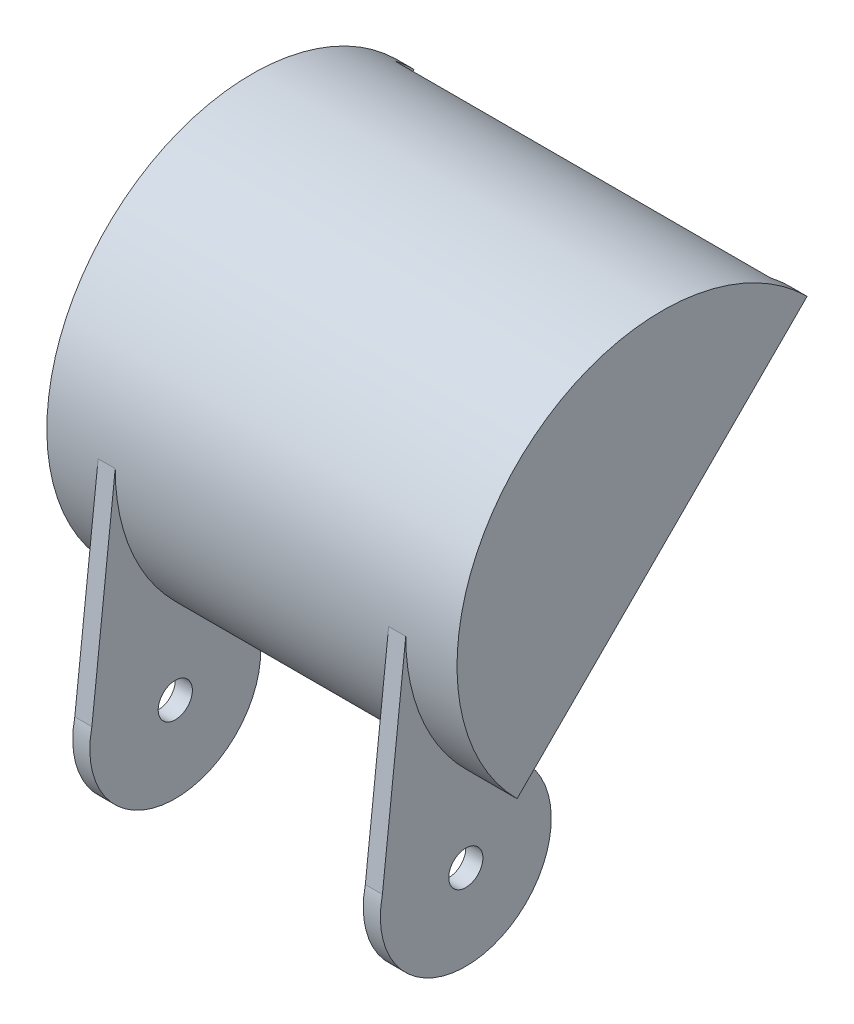
ISO-10303-21;
HEADER;
FILE_DESCRIPTION(('STEP AP214'),'2;1');
FILE_NAME('part.step','',(''),(''),'','','');
FILE_SCHEMA(('AUTOMOTIVE_DESIGN { 1 0 10303 214 1 1 1 1 }'));
ENDSEC;
DATA;
#1=APPLICATION_CONTEXT('core data for automotive mechanical design processes');
#2=APPLICATION_PROTOCOL_DEFINITION('international standard','automotive_design',2000,#1);
#3=PRODUCT_CONTEXT('',#1,'mechanical');
#4=PRODUCT('Part','Part','',(#3));
#5=PRODUCT_RELATED_PRODUCT_CATEGORY('part','',(#4));
#6=PRODUCT_DEFINITION_FORMATION('','',#4);
#7=PRODUCT_DEFINITION_CONTEXT('part definition',#1,'design');
#8=PRODUCT_DEFINITION('design','',#6,#7);
#9=PRODUCT_DEFINITION_SHAPE('','',#8);
#10=(LENGTH_UNIT() NAMED_UNIT(*) SI_UNIT(.MILLI.,.METRE.));
#11=(NAMED_UNIT(*) PLANE_ANGLE_UNIT() SI_UNIT($,.RADIAN.));
#12=(NAMED_UNIT(*) SI_UNIT($,.STERADIAN.) SOLID_ANGLE_UNIT());
#13=UNCERTAINTY_MEASURE_WITH_UNIT(LENGTH_MEASURE(1.E-05),#10,'distance_accuracy_value','');
#14=(GEOMETRIC_REPRESENTATION_CONTEXT(3) GLOBAL_UNCERTAINTY_ASSIGNED_CONTEXT((#13)) GLOBAL_UNIT_ASSIGNED_CONTEXT((#10,
#11,#12)) REPRESENTATION_CONTEXT('',''));
#15=CARTESIAN_POINT('',(0.,0.,0.));
#16=DIRECTION('',(0.,0.,1.));
#17=DIRECTION('',(1.,0.,0.));
#18=AXIS2_PLACEMENT_3D('',#15,#16,#17);
#19=CARTESIAN_POINT('',(28.575,2.24506403026729,-2.24506403026728));
#20=DIRECTION('',(0.,0.,1.));
#21=DIRECTION('',(1.,0.,0.));
#22=AXIS2_PLACEMENT_3D('',#19,#20,#21);
#23=PLANE('',#22);
#24=DIRECTION('',(0.,1.,0.));
#25=VECTOR('',#24,1.);
#26=CARTESIAN_POINT('',(-25.4,-0.15955178812898,-2.24506403026728));
#27=LINE('',#26,#25);
#28=CARTESIAN_POINT('',(-25.4,-0.15955178812898,-2.24506403026728));
#29=VERTEX_POINT('',#28);
#30=CARTESIAN_POINT('',(-25.4,2.24506403026729,-2.24506403026728));
#31=VERTEX_POINT('',#30);
#32=EDGE_CURVE('E205',#29,#31,#27,.T.);
#33=ORIENTED_EDGE('',*,*,#32,.F.);
#34=DIRECTION('',(-1.,0.,0.));
#35=VECTOR('',#34,1.);
#36=CARTESIAN_POINT('',(28.575,-0.15955178812898,-2.24506403026728));
#37=LINE('',#36,#35);
#38=CARTESIAN_POINT('',(-28.575,-0.15955178812898,-2.24506403026728));
#39=VERTEX_POINT('',#38);
#40=EDGE_CURVE('E215',#29,#39,#37,.T.);
#41=ORIENTED_EDGE('',*,*,#40,.T.);
#42=DIRECTION('',(0.,1.,0.));
#43=VECTOR('',#42,1.);
#44=CARTESIAN_POINT('',(-28.575,2.24506403026729,-2.24506403026728));
#45=LINE('',#44,#43);
#46=CARTESIAN_POINT('',(-28.575,2.24506403026729,-2.24506403026728));
#47=VERTEX_POINT('',#46);
#48=EDGE_CURVE('E422',#39,#47,#45,.T.);
#49=ORIENTED_EDGE('',*,*,#48,.T.);
#50=DIRECTION('',(-1.,0.,0.));
#51=VECTOR('',#50,1.);
#52=CARTESIAN_POINT('',(28.575,2.24506403026729,-2.24506403026728));
#53=LINE('',#52,#51);
#54=EDGE_CURVE('E70',#31,#47,#53,.T.);
#55=ORIENTED_EDGE('',*,*,#54,.F.);
#56=EDGE_LOOP('',(#33,#41,#49,#55));
#57=FACE_BOUND('',#56,.T.);
#58=ADVANCED_FACE('F47',(#57),#23,.F.);
#59=CARTESIAN_POINT('',(-75.0672223709817,26.9407683632072,11.1592316367926));
#60=DIRECTION('',(0.,0.109478882044128,0.993989121865208));
#61=DIRECTION('',(0.,-0.993989121865208,0.109478882044128));
#62=AXIS2_PLACEMENT_3D('',#59,#60,#61);
#63=PLANE('',#62);
#64=DIRECTION('',(-1.,0.,0.));
#65=VECTOR('',#64,1.);
#66=CARTESIAN_POINT('',(28.575,-12.4199390340299,15.4944563867672));
#67=LINE('',#66,#65);
#68=CARTESIAN_POINT('',(-25.4,-12.4199390340299,15.4944563867672));
#69=VERTEX_POINT('',#68);
#70=CARTESIAN_POINT('',(-28.575,-12.4199390340299,15.4944563867672));
#71=VERTEX_POINT('',#70);
#72=EDGE_CURVE('E369',#69,#71,#67,.T.);
#73=ORIENTED_EDGE('',*,*,#72,.F.);
#74=DIRECTION('',(0.,-0.993989121865208,0.109478882044128));
#75=VECTOR('',#74,1.);
#76=CARTESIAN_POINT('',(-25.4,26.9407683632072,11.1592316367926));
#77=LINE('',#76,#75);
#78=CARTESIAN_POINT('',(-25.4,26.9407683632072,11.1592316367926));
#79=VERTEX_POINT('',#78);
#80=EDGE_CURVE('E207',#79,#69,#77,.T.);
#81=ORIENTED_EDGE('',*,*,#80,.F.);
#82=DIRECTION('',(1.,0.,0.));
#83=VECTOR('',#82,1.);
#84=CARTESIAN_POINT('',(-75.0672223709817,26.9407683632072,11.1592316367926));
#85=LINE('',#84,#83);
#86=CARTESIAN_POINT('',(-28.575,26.9407683632072,11.1592316367926));
#87=VERTEX_POINT('',#86);
#88=EDGE_CURVE('E334',#87,#79,#85,.T.);
#89=ORIENTED_EDGE('',*,*,#88,.F.);
#90=DIRECTION('',(0.,0.993989121865208,-0.109478882044128));
#91=VECTOR('',#90,1.);
#92=CARTESIAN_POINT('',(-28.575,26.9407683632072,11.1592316367926));
#93=LINE('',#92,#91);
#94=EDGE_CURVE('E339',#71,#87,#93,.T.);
#95=ORIENTED_EDGE('',*,*,#94,.F.);
#96=EDGE_LOOP('',(#73,#81,#89,#95));
#97=FACE_BOUND('',#96,.T.);
#98=ADVANCED_FACE('F768',(#97),#63,.T.);
#99=CARTESIAN_POINT('',(28.575,-15.875,0.));
#100=DIRECTION('',(-1.,0.,0.));
#101=DIRECTION('',(0.,0.,1.));
#102=AXIS2_PLACEMENT_3D('',#99,#100,#101);
#103=CYLINDRICAL_SURFACE('',#102,15.875);
#104=CARTESIAN_POINT('',(-25.4,-15.875,0.));
#105=DIRECTION('',(1.,0.,0.));
#106=DIRECTION('',(0.,0.,-1.));
#107=AXIS2_PLACEMENT_3D('',#104,#105,#106);
#108=CIRCLE('',#107,15.875);
#109=EDGE_CURVE('E12',#69,#29,#108,.T.);
#110=ORIENTED_EDGE('',*,*,#109,.F.);
#111=ORIENTED_EDGE('',*,*,#72,.T.);
#112=CARTESIAN_POINT('',(-28.575,-15.875,0.));
#113=DIRECTION('',(1.,0.,0.));
#114=DIRECTION('',(0.,0.,-1.));
#115=AXIS2_PLACEMENT_3D('',#112,#113,#114);
#116=CIRCLE('',#115,15.875);
#117=EDGE_CURVE('E223',#71,#39,#116,.T.);
#118=ORIENTED_EDGE('',*,*,#117,.T.);
#119=ORIENTED_EDGE('',*,*,#40,.F.);
#120=EDGE_LOOP('',(#110,#111,#118,#119));
#121=FACE_BOUND('',#120,.T.);
#122=ADVANCED_FACE('F221',(#121),#103,.T.);
#123=CARTESIAN_POINT('',(38.1,0.,0.));
#124=DIRECTION('',(0.,0.707106781186546,0.707106781186549));
#125=DIRECTION('',(0.,-0.707106781186549,0.707106781186546));
#126=AXIS2_PLACEMENT_3D('',#123,#124,#125);
#127=PLANE('',#126);
#128=DIRECTION('',(0.,-0.707106781186549,0.707106781186546));
#129=VECTOR('',#128,1.);
#130=CARTESIAN_POINT('',(-28.575,2.24506403026729,-2.24506403026728));
#131=LINE('',#130,#129);
#132=CARTESIAN_POINT('',(-28.575,0.,0.));
#133=VERTEX_POINT('',#132);
#134=EDGE_CURVE('E499',#47,#133,#131,.T.);
#135=ORIENTED_EDGE('',*,*,#134,.T.);
#136=DIRECTION('',(-1.,0.,0.));
#137=VECTOR('',#136,1.);
#138=CARTESIAN_POINT('',(38.1,0.,0.));
#139=LINE('',#138,#137);
#140=CARTESIAN_POINT('',(-38.1,0.,0.));
#141=VERTEX_POINT('',#140);
#142=EDGE_CURVE('E387',#133,#141,#139,.T.);
#143=ORIENTED_EDGE('',*,*,#142,.T.);
#144=DIRECTION('',(0.,0.707106781186549,-0.707106781186546));
#145=VECTOR('',#144,1.);
#146=CARTESIAN_POINT('',(-38.1,0.,0.));
#147=LINE('',#146,#145);
#148=CARTESIAN_POINT('',(-38.1,53.881536726415,-53.8815367264148));
#149=VERTEX_POINT('',#148);
#150=EDGE_CURVE('E457',#141,#149,#147,.T.);
#151=ORIENTED_EDGE('',*,*,#150,.T.);
#152=DIRECTION('',(-1.,0.,0.));
#153=VECTOR('',#152,1.);
#154=CARTESIAN_POINT('',(38.1,53.881536726415,-53.8815367264148));
#155=LINE('',#154,#153);
#156=CARTESIAN_POINT('',(-34.925,53.881536726415,-53.8815367264148));
#157=VERTEX_POINT('',#156);
#158=EDGE_CURVE('E573',#157,#149,#155,.T.);
#159=ORIENTED_EDGE('',*,*,#158,.F.);
#160=DIRECTION('',(0.,0.707106781186549,-0.707106781186546));
#161=VECTOR('',#160,1.);
#162=CARTESIAN_POINT('',(-34.925,0.,0.));
#163=LINE('',#162,#161);
#164=CARTESIAN_POINT('',(-34.925,2.24506403026729,-2.24506403026728));
#165=VERTEX_POINT('',#164);
#166=EDGE_CURVE('E441',#165,#157,#163,.T.);
#167=ORIENTED_EDGE('',*,*,#166,.F.);
#168=DIRECTION('',(-1.,0.,0.));
#169=VECTOR('',#168,1.);
#170=CARTESIAN_POINT('',(34.925,2.24506403026729,-2.24506403026728));
#171=LINE('',#170,#169);
#172=EDGE_CURVE('E438',#47,#165,#171,.T.);
#173=ORIENTED_EDGE('',*,*,#172,.F.);
#174=EDGE_LOOP('',(#135,#143,#151,#159,#167,#173));
#175=FACE_BOUND('',#174,.T.);
#176=ADVANCED_FACE('F598',(#175),#127,.F.);
#177=CARTESIAN_POINT('',(38.1,0.,0.));
#178=VERTEX_POINT('',#177);
#179=CARTESIAN_POINT('',(28.575,0.,0.));
#180=VERTEX_POINT('',#179);
#181=EDGE_CURVE('E380',#178,#180,#139,.T.);
#182=ORIENTED_EDGE('',*,*,#181,.T.);
#183=DIRECTION('',(0.,-0.707106781186549,0.707106781186546));
#184=VECTOR('',#183,1.);
#185=CARTESIAN_POINT('',(28.575,2.24506403026729,-2.24506403026728));
#186=LINE('',#185,#184);
#187=CARTESIAN_POINT('',(28.575,2.24506403026729,-2.24506403026728));
#188=VERTEX_POINT('',#187);
#189=EDGE_CURVE('E416',#188,#180,#186,.T.);
#190=ORIENTED_EDGE('',*,*,#189,.F.);
#191=CARTESIAN_POINT('',(34.925,2.24506403026729,-2.24506403026728));
#192=VERTEX_POINT('',#191);
#193=EDGE_CURVE('E432',#192,#188,#171,.T.);
#194=ORIENTED_EDGE('',*,*,#193,.F.);
#195=DIRECTION('',(0.,0.707106781186549,-0.707106781186546));
#196=VECTOR('',#195,1.);
#197=CARTESIAN_POINT('',(34.925,0.,0.));
#198=LINE('',#197,#196);
#199=CARTESIAN_POINT('',(34.925,53.881536726415,-53.8815367264148));
#200=VERTEX_POINT('',#199);
#201=EDGE_CURVE('E82',#192,#200,#198,.T.);
#202=ORIENTED_EDGE('',*,*,#201,.T.);
#203=CARTESIAN_POINT('',(38.1,53.881536726415,-53.8815367264148));
#204=VERTEX_POINT('',#203);
#205=EDGE_CURVE('E388',#204,#200,#155,.T.);
#206=ORIENTED_EDGE('',*,*,#205,.F.);
#207=DIRECTION('',(0.,0.707106781186549,-0.707106781186546));
#208=VECTOR('',#207,1.);
#209=CARTESIAN_POINT('',(38.1,0.,0.));
#210=LINE('',#209,#208);
#211=EDGE_CURVE('E567',#178,#204,#210,.T.);
#212=ORIENTED_EDGE('',*,*,#211,.F.);
#213=EDGE_LOOP('',(#182,#190,#194,#202,#206,#212));
#214=FACE_BOUND('',#213,.T.);
#215=ADVANCED_FACE('F749',(#214),#127,.F.);
#216=CARTESIAN_POINT('',(38.1,26.9407683632075,-26.9407683632074));
#217=DIRECTION('',(-1.,0.,0.));
#218=DIRECTION('',(0.,0.,1.));
#219=AXIS2_PLACEMENT_3D('',#216,#217,#218);
#220=CYLINDRICAL_SURFACE('',#219,38.1);
#221=ORIENTED_EDGE('',*,*,#88,.T.);
#222=CARTESIAN_POINT('',(-25.4,26.9407683632075,-26.9407683632074));
#223=DIRECTION('',(-1.,0.,0.));
#224=DIRECTION('',(0.,0.,-1.));
#225=AXIS2_PLACEMENT_3D('',#222,#223,#224);
#226=CIRCLE('',#225,38.1);
#227=CARTESIAN_POINT('',(-25.4,0.,0.));
#228=VERTEX_POINT('',#227);
#229=EDGE_CURVE('E511',#228,#79,#226,.T.);
#230=ORIENTED_EDGE('',*,*,#229,.F.);
#231=DIRECTION('',(1.,0.,0.));
#232=VECTOR('',#231,1.);
#233=CARTESIAN_POINT('',(-25.4,0.,0.));
#234=LINE('',#233,#232);
#235=CARTESIAN_POINT('',(25.4,0.,0.));
#236=VERTEX_POINT('',#235);
#237=EDGE_CURVE('E310',#228,#236,#234,.T.);
#238=ORIENTED_EDGE('',*,*,#237,.T.);
#239=CARTESIAN_POINT('',(25.4,26.9407683632075,-26.9407683632074));
#240=DIRECTION('',(-1.,0.,0.));
#241=DIRECTION('',(0.,0.,-1.));
#242=AXIS2_PLACEMENT_3D('',#239,#240,#241);
#243=CIRCLE('',#242,38.1);
#244=CARTESIAN_POINT('',(25.4,26.9407683632072,11.1592316367926));
#245=VERTEX_POINT('',#244);
#246=EDGE_CURVE('E294',#236,#245,#243,.T.);
#247=ORIENTED_EDGE('',*,*,#246,.T.);
#248=CARTESIAN_POINT('',(28.575,26.9407683632072,11.1592316367926));
#249=VERTEX_POINT('',#248);
#250=EDGE_CURVE('E340',#245,#249,#85,.T.);
#251=ORIENTED_EDGE('',*,*,#250,.T.);
#252=CARTESIAN_POINT('',(28.575,26.9407683632075,-26.9407683632074));
#253=DIRECTION('',(1.,0.,0.));
#254=DIRECTION('',(0.,0.,-1.));
#255=AXIS2_PLACEMENT_3D('',#252,#253,#254);
#256=CIRCLE('',#255,38.1);
#257=EDGE_CURVE('E363',#249,#180,#256,.T.);
#258=ORIENTED_EDGE('',*,*,#257,.T.);
#259=ORIENTED_EDGE('',*,*,#181,.F.);
#260=CARTESIAN_POINT('',(38.1,26.9407683632075,-26.9407683632074));
#261=DIRECTION('',(1.,0.,0.));
#262=DIRECTION('',(0.,0.,-1.));
#263=AXIS2_PLACEMENT_3D('',#260,#261,#262);
#264=CIRCLE('',#263,38.1);
#265=EDGE_CURVE('E462',#204,#178,#264,.T.);
#266=ORIENTED_EDGE('',*,*,#265,.F.);
#267=ORIENTED_EDGE('',*,*,#205,.T.);
#268=CARTESIAN_POINT('',(34.925,26.9407683632075,-26.9407683632074));
#269=DIRECTION('',(1.,0.,0.));
#270=DIRECTION('',(0.,0.,-1.));
#271=AXIS2_PLACEMENT_3D('',#268,#269,#270);
#272=CIRCLE('',#271,38.1);
#273=CARTESIAN_POINT('',(34.925,57.0511320390414,-50.2854893790821));
#274=VERTEX_POINT('',#273);
#275=EDGE_CURVE('E386',#200,#274,#272,.T.);
#276=ORIENTED_EDGE('',*,*,#275,.T.);
#277=DIRECTION('',(-1.,0.,0.));
#278=VECTOR('',#277,1.);
#279=CARTESIAN_POINT('',(0.,57.0511320390414,-50.2854893790821));
#280=LINE('',#279,#278);
#281=CARTESIAN_POINT('',(-34.925,57.0511320390414,-50.2854893790821));
#282=VERTEX_POINT('',#281);
#283=EDGE_CURVE('E551',#274,#282,#280,.T.);
#284=ORIENTED_EDGE('',*,*,#283,.T.);
#285=CARTESIAN_POINT('',(-34.925,26.9407683632075,-26.9407683632074));
#286=DIRECTION('',(1.,0.,0.));
#287=DIRECTION('',(0.,0.,-1.));
#288=AXIS2_PLACEMENT_3D('',#285,#286,#287);
#289=CIRCLE('',#288,38.1);
#290=EDGE_CURVE('E548',#282,#157,#289,.F.);
#291=ORIENTED_EDGE('',*,*,#290,.T.);
#292=ORIENTED_EDGE('',*,*,#158,.T.);
#293=CARTESIAN_POINT('',(-38.1,26.9407683632075,-26.9407683632074));
#294=DIRECTION('',(1.,0.,0.));
#295=DIRECTION('',(0.,0.,-1.));
#296=AXIS2_PLACEMENT_3D('',#293,#294,#295);
#297=CIRCLE('',#296,38.1);
#298=EDGE_CURVE('E437',#149,#141,#297,.T.);
#299=ORIENTED_EDGE('',*,*,#298,.T.);
#300=ORIENTED_EDGE('',*,*,#142,.F.);
#301=CARTESIAN_POINT('',(-28.575,26.9407683632075,-26.9407683632074));
#302=DIRECTION('',(1.,0.,0.));
#303=DIRECTION('',(0.,0.,-1.));
#304=AXIS2_PLACEMENT_3D('',#301,#302,#303);
#305=CIRCLE('',#304,38.1);
#306=EDGE_CURVE('E368',#87,#133,#305,.T.);
#307=ORIENTED_EDGE('',*,*,#306,.F.);
#308=EDGE_LOOP('',(#221,#230,#238,#247,#251,#258,#259,#266,#267,#276,#284,#291,#292,#299,#300,#307));
#309=FACE_BOUND('',#308,.T.);
#310=ADVANCED_FACE('F604',(#309),#220,.T.);
#311=CARTESIAN_POINT('',(38.1,26.9407683632075,-26.9407683632074));
#312=DIRECTION('',(1.,0.,0.));
#313=DIRECTION('',(0.,0.,-1.));
#314=AXIS2_PLACEMENT_3D('',#311,#312,#313);
#315=PLANE('',#314);
#316=ORIENTED_EDGE('',*,*,#265,.T.);
#317=ORIENTED_EDGE('',*,*,#211,.T.);
#318=EDGE_LOOP('',(#316,#317));
#319=FACE_BOUND('',#318,.T.);
#320=ADVANCED_FACE('F820',(#319),#315,.T.);
#321=CARTESIAN_POINT('',(-38.1,26.9407683632075,-26.9407683632074));
#322=DIRECTION('',(1.,0.,0.));
#323=DIRECTION('',(0.,0.,-1.));
#324=AXIS2_PLACEMENT_3D('',#321,#322,#323);
#325=PLANE('',#324);
#326=ORIENTED_EDGE('',*,*,#298,.F.);
#327=ORIENTED_EDGE('',*,*,#150,.F.);
#328=EDGE_LOOP('',(#326,#327));
#329=FACE_BOUND('',#328,.T.);
#330=ADVANCED_FACE('F603',(#329),#325,.F.);
#331=CARTESIAN_POINT('',(38.1,26.9407683632075,-26.9407683632074));
#332=DIRECTION('',(-1.,0.,0.));
#333=DIRECTION('',(0.,0.,1.));
#334=AXIS2_PLACEMENT_3D('',#331,#332,#333);
#335=CYLINDRICAL_SURFACE('',#334,34.925);
#336=ORIENTED_EDGE('',*,*,#193,.T.);
#337=CARTESIAN_POINT('',(25.4,2.24506403026729,-2.24506403026728));
#338=VERTEX_POINT('',#337);
#339=EDGE_CURVE('E226',#188,#338,#53,.T.);
#340=ORIENTED_EDGE('',*,*,#339,.T.);
#341=DIRECTION('',(1.,0.,0.));
#342=VECTOR('',#341,1.);
#343=CARTESIAN_POINT('',(-25.4,2.24506403026729,-2.24506403026728));
#344=LINE('',#343,#342);
#345=EDGE_CURVE('E315',#31,#338,#344,.T.);
#346=ORIENTED_EDGE('',*,*,#345,.F.);
#347=ORIENTED_EDGE('',*,*,#54,.T.);
#348=ORIENTED_EDGE('',*,*,#172,.T.);
#349=CARTESIAN_POINT('',(-34.925,26.9407683632075,-26.9407683632074));
#350=DIRECTION('',(1.,0.,0.));
#351=DIRECTION('',(0.,0.,-1.));
#352=AXIS2_PLACEMENT_3D('',#349,#350,#351);
#353=CIRCLE('',#352,34.925);
#354=CARTESIAN_POINT('',(-34.925,56.513988483178,-45.5197962370164));
#355=VERTEX_POINT('',#354);
#356=EDGE_CURVE('E232',#355,#165,#353,.T.);
#357=ORIENTED_EDGE('',*,*,#356,.F.);
#358=DIRECTION('',(-1.,0.,0.));
#359=VECTOR('',#358,1.);
#360=CARTESIAN_POINT('',(38.1,56.513988483178,-45.5197962370164));
#361=LINE('',#360,#359);
#362=CARTESIAN_POINT('',(34.925,56.513988483178,-45.5197962370164));
#363=VERTEX_POINT('',#362);
#364=EDGE_CURVE('E544',#355,#363,#361,.F.);
#365=ORIENTED_EDGE('',*,*,#364,.T.);
#366=CARTESIAN_POINT('',(34.925,26.9407683632075,-26.9407683632074));
#367=DIRECTION('',(1.,0.,0.));
#368=DIRECTION('',(0.,0.,-1.));
#369=AXIS2_PLACEMENT_3D('',#366,#367,#368);
#370=CIRCLE('',#369,34.925);
#371=EDGE_CURVE('E439',#363,#192,#370,.T.);
#372=ORIENTED_EDGE('',*,*,#371,.T.);
#373=EDGE_LOOP('',(#336,#340,#346,#347,#348,#357,#365,#372));
#374=FACE_BOUND('',#373,.T.);
#375=ADVANCED_FACE('F745',(#374),#335,.F.);
#376=CARTESIAN_POINT('',(34.925,26.9407683632075,-26.9407683632074));
#377=DIRECTION('',(1.,0.,0.));
#378=DIRECTION('',(0.,0.,-1.));
#379=AXIS2_PLACEMENT_3D('',#376,#377,#378);
#380=PLANE('',#379);
#381=ORIENTED_EDGE('',*,*,#371,.F.);
#382=DIRECTION('',(0.,-0.11200131110685,0.993708058893731));
#383=VECTOR('',#382,1.);
#384=CARTESIAN_POINT('',(34.925,54.0752305896627,-23.8824301336417));
#385=LINE('',#384,#383);
#386=EDGE_CURVE('E59',#363,#274,#385,.F.);
#387=ORIENTED_EDGE('',*,*,#386,.T.);
#388=ORIENTED_EDGE('',*,*,#275,.F.);
#389=ORIENTED_EDGE('',*,*,#201,.F.);
#390=EDGE_LOOP('',(#381,#387,#388,#389));
#391=FACE_BOUND('',#390,.T.);
#392=ADVANCED_FACE('F747',(#391),#380,.F.);
#393=CARTESIAN_POINT('',(-34.925,26.9407683632075,-26.9407683632074));
#394=DIRECTION('',(1.,0.,0.));
#395=DIRECTION('',(0.,0.,-1.));
#396=AXIS2_PLACEMENT_3D('',#393,#394,#395);
#397=PLANE('',#396);
#398=ORIENTED_EDGE('',*,*,#166,.T.);
#399=ORIENTED_EDGE('',*,*,#290,.F.);
#400=DIRECTION('',(0.,0.11200131110685,-0.993708058893731));
#401=VECTOR('',#400,1.);
#402=CARTESIAN_POINT('',(-34.925,57.9105570692999,-57.9105570692997));
#403=LINE('',#402,#401);
#404=EDGE_CURVE('E541',#282,#355,#403,.F.);
#405=ORIENTED_EDGE('',*,*,#404,.T.);
#406=ORIENTED_EDGE('',*,*,#356,.T.);
#407=EDGE_LOOP('',(#398,#399,#405,#406));
#408=FACE_BOUND('',#407,.T.);
#409=ADVANCED_FACE('F743',(#408),#397,.T.);
#410=CARTESIAN_POINT('',(38.1,57.9105570692999,-57.9105570692997));
#411=DIRECTION('',(0.,0.993708058893731,0.11200131110685));
#412=DIRECTION('',(-1.,0.,0.));
#413=AXIS2_PLACEMENT_3D('',#410,#411,#412);
#414=PLANE('',#413);
#415=ORIENTED_EDGE('',*,*,#386,.F.);
#416=ORIENTED_EDGE('',*,*,#364,.F.);
#417=ORIENTED_EDGE('',*,*,#404,.F.);
#418=ORIENTED_EDGE('',*,*,#283,.F.);
#419=EDGE_LOOP('',(#415,#416,#417,#418));
#420=FACE_BOUND('',#419,.T.);
#421=ADVANCED_FACE('F50',(#420),#414,.F.);
#422=CARTESIAN_POINT('',(28.575,-0.159551788128983,-2.24506403026728));
#423=VERTEX_POINT('',#422);
#424=CARTESIAN_POINT('',(25.4,-0.15955178812898,-2.24506403026728));
#425=VERTEX_POINT('',#424);
#426=EDGE_CURVE('E225',#423,#425,#37,.T.);
#427=ORIENTED_EDGE('',*,*,#426,.T.);
#428=DIRECTION('',(0.,1.,0.));
#429=VECTOR('',#428,1.);
#430=CARTESIAN_POINT('',(25.4,-0.15955178812898,-2.24506403026728));
#431=LINE('',#430,#429);
#432=EDGE_CURVE('E295',#425,#338,#431,.T.);
#433=ORIENTED_EDGE('',*,*,#432,.T.);
#434=ORIENTED_EDGE('',*,*,#339,.F.);
#435=DIRECTION('',(0.,1.,0.));
#436=VECTOR('',#435,1.);
#437=CARTESIAN_POINT('',(28.575,2.24506403026729,-2.24506403026728));
#438=LINE('',#437,#436);
#439=EDGE_CURVE('E421',#423,#188,#438,.T.);
#440=ORIENTED_EDGE('',*,*,#439,.F.);
#441=EDGE_LOOP('',(#427,#433,#434,#440));
#442=FACE_BOUND('',#441,.T.);
#443=ADVANCED_FACE('F753',(#442),#23,.F.);
#444=CARTESIAN_POINT('',(28.575,0.,0.));
#445=DIRECTION('',(1.,0.,0.));
#446=DIRECTION('',(0.,0.,-1.));
#447=AXIS2_PLACEMENT_3D('',#444,#445,#446);
#448=PLANE('',#447);
#449=CARTESIAN_POINT('',(28.575,-15.875,0.));
#450=DIRECTION('',(1.,0.,0.));
#451=DIRECTION('',(0.,0.,-1.));
#452=AXIS2_PLACEMENT_3D('',#449,#450,#451);
#453=CIRCLE('',#452,15.875);
#454=CARTESIAN_POINT('',(28.575,-12.4199390340299,15.4944563867672));
#455=VERTEX_POINT('',#454);
#456=EDGE_CURVE('E277',#455,#423,#453,.T.);
#457=ORIENTED_EDGE('',*,*,#456,.T.);
#458=ORIENTED_EDGE('',*,*,#439,.T.);
#459=ORIENTED_EDGE('',*,*,#189,.T.);
#460=ORIENTED_EDGE('',*,*,#257,.F.);
#461=DIRECTION('',(0.,-0.993989121865208,0.109478882044128));
#462=VECTOR('',#461,1.);
#463=CARTESIAN_POINT('',(28.575,26.9407683632072,11.1592316367926));
#464=LINE('',#463,#462);
#465=EDGE_CURVE('E314',#249,#455,#464,.T.);
#466=ORIENTED_EDGE('',*,*,#465,.T.);
#467=EDGE_LOOP('',(#457,#458,#459,#460,#466));
#468=FACE_BOUND('',#467,.T.);
#469=CARTESIAN_POINT('',(28.575,-15.875,0.));
#470=DIRECTION('',(1.,0.,0.));
#471=DIRECTION('',(0.,0.,-1.));
#472=AXIS2_PLACEMENT_3D('',#469,#470,#471);
#473=CIRCLE('',#472,3.175);
#474=CARTESIAN_POINT('',(28.575,-15.875,-3.175));
#475=VERTEX_POINT('',#474);
#476=EDGE_CURVE('E492',#475,#475,#473,.F.);
#477=ORIENTED_EDGE('',*,*,#476,.T.);
#478=EDGE_LOOP('',(#477));
#479=FACE_BOUND('',#478,.T.);
#480=ADVANCED_FACE('F774',(#468,#479),#448,.T.);
#481=CARTESIAN_POINT('',(-28.575,0.,0.));
#482=DIRECTION('',(1.,0.,0.));
#483=DIRECTION('',(0.,0.,-1.));
#484=AXIS2_PLACEMENT_3D('',#481,#482,#483);
#485=PLANE('',#484);
#486=ORIENTED_EDGE('',*,*,#117,.F.);
#487=ORIENTED_EDGE('',*,*,#94,.T.);
#488=ORIENTED_EDGE('',*,*,#306,.T.);
#489=ORIENTED_EDGE('',*,*,#134,.F.);
#490=ORIENTED_EDGE('',*,*,#48,.F.);
#491=EDGE_LOOP('',(#486,#487,#488,#489,#490));
#492=FACE_BOUND('',#491,.T.);
#493=CARTESIAN_POINT('',(-28.575,-15.875,0.));
#494=DIRECTION('',(-1.,0.,0.));
#495=DIRECTION('',(0.,0.,1.));
#496=AXIS2_PLACEMENT_3D('',#493,#494,#495);
#497=CIRCLE('',#496,3.175);
#498=CARTESIAN_POINT('',(-28.575,-15.875,3.175));
#499=VERTEX_POINT('',#498);
#500=EDGE_CURVE('E488',#499,#499,#497,.T.);
#501=ORIENTED_EDGE('',*,*,#500,.F.);
#502=EDGE_LOOP('',(#501));
#503=FACE_BOUND('',#502,.T.);
#504=ADVANCED_FACE('F770',(#492,#503),#485,.F.);
#505=ORIENTED_EDGE('',*,*,#456,.F.);
#506=DIRECTION('',(-1.,0.,0.));
#507=VECTOR('',#506,1.);
#508=CARTESIAN_POINT('',(28.575,-12.4199390340299,15.4944563867672));
#509=LINE('',#508,#507);
#510=CARTESIAN_POINT('',(25.4,-12.4199390340299,15.4944563867672));
#511=VERTEX_POINT('',#510);
#512=EDGE_CURVE('E474',#455,#511,#509,.T.);
#513=ORIENTED_EDGE('',*,*,#512,.T.);
#514=CARTESIAN_POINT('',(25.4,-15.875,0.));
#515=DIRECTION('',(1.,0.,0.));
#516=DIRECTION('',(0.,0.,-1.));
#517=AXIS2_PLACEMENT_3D('',#514,#515,#516);
#518=CIRCLE('',#517,15.875);
#519=EDGE_CURVE('E269',#511,#425,#518,.T.);
#520=ORIENTED_EDGE('',*,*,#519,.T.);
#521=ORIENTED_EDGE('',*,*,#426,.F.);
#522=EDGE_LOOP('',(#505,#513,#520,#521));
#523=FACE_BOUND('',#522,.T.);
#524=ADVANCED_FACE('F773',(#523),#103,.T.);
#525=CARTESIAN_POINT('',(-25.4,-15.875,0.));
#526=DIRECTION('',(1.,0.,0.));
#527=DIRECTION('',(0.,0.,-1.));
#528=AXIS2_PLACEMENT_3D('',#525,#526,#527);
#529=PLANE('',#528);
#530=ORIENTED_EDGE('',*,*,#109,.T.);
#531=ORIENTED_EDGE('',*,*,#32,.T.);
#532=DIRECTION('',(0.,-0.707106781186549,0.707106781186546));
#533=VECTOR('',#532,1.);
#534=CARTESIAN_POINT('',(-25.4,2.24506403026729,-2.24506403026728));
#535=LINE('',#534,#533);
#536=EDGE_CURVE('E218',#31,#228,#535,.T.);
#537=ORIENTED_EDGE('',*,*,#536,.T.);
#538=ORIENTED_EDGE('',*,*,#229,.T.);
#539=ORIENTED_EDGE('',*,*,#80,.T.);
#540=EDGE_LOOP('',(#530,#531,#537,#538,#539));
#541=FACE_BOUND('',#540,.T.);
#542=CARTESIAN_POINT('',(-25.4,-15.875,0.));
#543=DIRECTION('',(1.,0.,0.));
#544=DIRECTION('',(0.,0.,-1.));
#545=AXIS2_PLACEMENT_3D('',#542,#543,#544);
#546=CIRCLE('',#545,3.175);
#547=CARTESIAN_POINT('',(-25.4,-15.875,-3.175));
#548=VERTEX_POINT('',#547);
#549=EDGE_CURVE('E274',#548,#548,#546,.T.);
#550=ORIENTED_EDGE('',*,*,#549,.F.);
#551=EDGE_LOOP('',(#550));
#552=FACE_BOUND('',#551,.T.);
#553=ADVANCED_FACE('F202',(#541,#552),#529,.T.);
#554=CARTESIAN_POINT('',(25.4,-15.875,0.));
#555=DIRECTION('',(1.,0.,0.));
#556=DIRECTION('',(0.,0.,-1.));
#557=AXIS2_PLACEMENT_3D('',#554,#555,#556);
#558=PLANE('',#557);
#559=ORIENTED_EDGE('',*,*,#519,.F.);
#560=DIRECTION('',(0.,-0.993989121865208,0.109478882044128));
#561=VECTOR('',#560,1.);
#562=CARTESIAN_POINT('',(25.4,26.9407683632072,11.1592316367926));
#563=LINE('',#562,#561);
#564=EDGE_CURVE('E219',#245,#511,#563,.T.);
#565=ORIENTED_EDGE('',*,*,#564,.F.);
#566=ORIENTED_EDGE('',*,*,#246,.F.);
#567=DIRECTION('',(0.,-0.707106781186549,0.707106781186546));
#568=VECTOR('',#567,1.);
#569=CARTESIAN_POINT('',(25.4,2.24506403026729,-2.24506403026728));
#570=LINE('',#569,#568);
#571=EDGE_CURVE('E288',#338,#236,#570,.T.);
#572=ORIENTED_EDGE('',*,*,#571,.F.);
#573=ORIENTED_EDGE('',*,*,#432,.F.);
#574=EDGE_LOOP('',(#559,#565,#566,#572,#573));
#575=FACE_BOUND('',#574,.T.);
#576=CARTESIAN_POINT('',(25.4,-15.875,0.));
#577=DIRECTION('',(1.,0.,0.));
#578=DIRECTION('',(0.,0.,-1.));
#579=AXIS2_PLACEMENT_3D('',#576,#577,#578);
#580=CIRCLE('',#579,3.175);
#581=CARTESIAN_POINT('',(25.4,-15.875,-3.175));
#582=VERTEX_POINT('',#581);
#583=EDGE_CURVE('E52',#582,#582,#580,.T.);
#584=ORIENTED_EDGE('',*,*,#583,.T.);
#585=EDGE_LOOP('',(#584));
#586=FACE_BOUND('',#585,.T.);
#587=ADVANCED_FACE('F759',(#575,#586),#558,.F.);
#588=CARTESIAN_POINT('',(37.5552561210691,-15.875,0.));
#589=DIRECTION('',(-1.,0.,0.));
#590=DIRECTION('',(0.,0.,1.));
#591=AXIS2_PLACEMENT_3D('',#588,#589,#590);
#592=CYLINDRICAL_SURFACE('',#591,3.175);
#593=ORIENTED_EDGE('',*,*,#476,.F.);
#594=EDGE_LOOP('',(#593));
#595=FACE_BOUND('',#594,.T.);
#596=ORIENTED_EDGE('',*,*,#583,.F.);
#597=EDGE_LOOP('',(#596));
#598=FACE_BOUND('',#597,.T.);
#599=ADVANCED_FACE('F781',(#595,#598),#592,.F.);
#600=ORIENTED_EDGE('',*,*,#549,.T.);
#601=EDGE_LOOP('',(#600));
#602=FACE_BOUND('',#601,.T.);
#603=ORIENTED_EDGE('',*,*,#500,.T.);
#604=EDGE_LOOP('',(#603));
#605=FACE_BOUND('',#604,.T.);
#606=ADVANCED_FACE('F778',(#602,#605),#592,.F.);
#607=ORIENTED_EDGE('',*,*,#564,.T.);
#608=ORIENTED_EDGE('',*,*,#512,.F.);
#609=ORIENTED_EDGE('',*,*,#465,.F.);
#610=ORIENTED_EDGE('',*,*,#250,.F.);
#611=EDGE_LOOP('',(#607,#608,#609,#610));
#612=FACE_BOUND('',#611,.T.);
#613=ADVANCED_FACE('F780',(#612),#63,.T.);
#614=CARTESIAN_POINT('',(-25.4,2.24506403026729,-2.24506403026728));
#615=DIRECTION('',(0.,0.707106781186546,0.707106781186549));
#616=DIRECTION('',(0.,-0.707106781186549,0.707106781186546));
#617=AXIS2_PLACEMENT_3D('',#614,#615,#616);
#618=PLANE('',#617);
#619=ORIENTED_EDGE('',*,*,#571,.T.);
#620=ORIENTED_EDGE('',*,*,#237,.F.);
#621=ORIENTED_EDGE('',*,*,#536,.F.);
#622=ORIENTED_EDGE('',*,*,#345,.T.);
#623=EDGE_LOOP('',(#619,#620,#621,#622));
#624=FACE_BOUND('',#623,.T.);
#625=ADVANCED_FACE('F764',(#624),#618,.F.);
#626=CLOSED_SHELL('',(#58,#98,#122,#176,#215,#310,#320,#330,#375,#392,#409,#421,#443,#480,#504,
#524,#553,#587,#599,#606,#613,#625));
#627=MANIFOLD_SOLID_BREP('B2',#626);
#628=ADVANCED_BREP_SHAPE_REPRESENTATION('',(#18,#627),#14);
#629=SHAPE_DEFINITION_REPRESENTATION(#9,#628);
ENDSEC;
END-ISO-10303-21;
